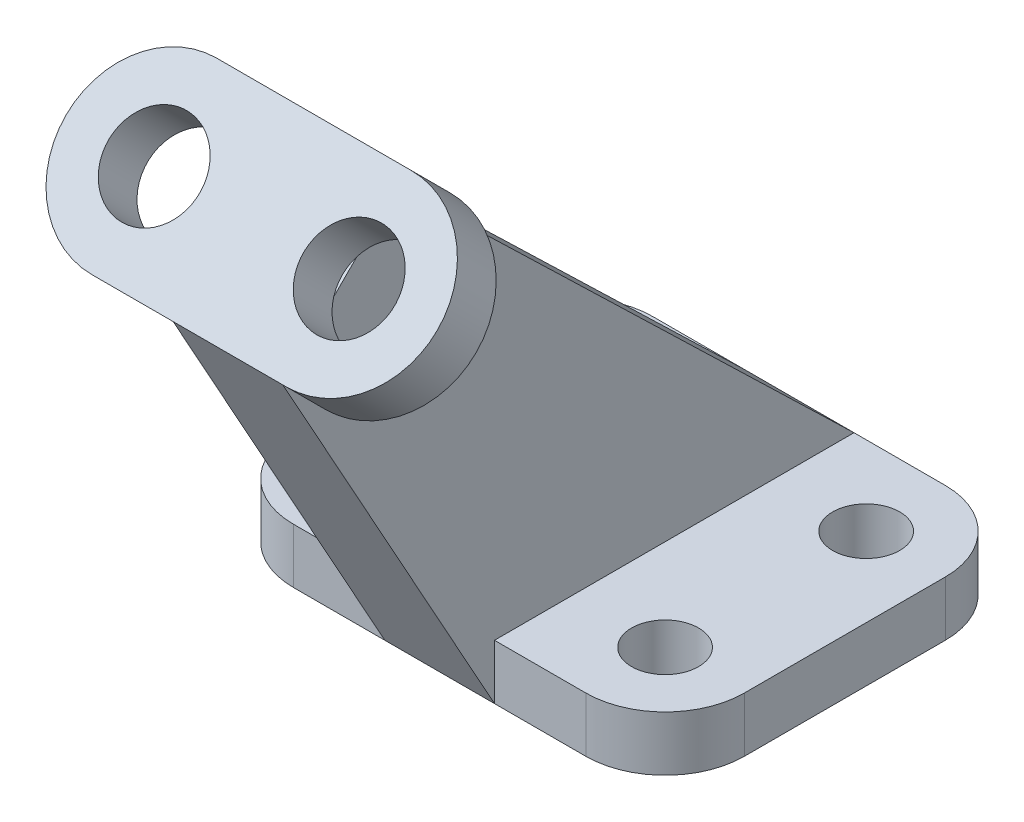
ISO-10303-21;
HEADER;
FILE_DESCRIPTION(('STEP AP214'),'2;1');
FILE_NAME('part.step','',(''),(''),'','','');
FILE_SCHEMA(('AUTOMOTIVE_DESIGN { 1 0 10303 214 1 1 1 1 }'));
ENDSEC;
DATA;
#1=APPLICATION_CONTEXT('core data for automotive mechanical design processes');
#2=APPLICATION_PROTOCOL_DEFINITION('international standard','automotive_design',2000,#1);
#3=PRODUCT_CONTEXT('',#1,'mechanical');
#4=PRODUCT('Part','Part','',(#3));
#5=PRODUCT_RELATED_PRODUCT_CATEGORY('part','',(#4));
#6=PRODUCT_DEFINITION_FORMATION('','',#4);
#7=PRODUCT_DEFINITION_CONTEXT('part definition',#1,'design');
#8=PRODUCT_DEFINITION('design','',#6,#7);
#9=PRODUCT_DEFINITION_SHAPE('','',#8);
#10=(LENGTH_UNIT() NAMED_UNIT(*) SI_UNIT(.MILLI.,.METRE.));
#11=(NAMED_UNIT(*) PLANE_ANGLE_UNIT() SI_UNIT($,.RADIAN.));
#12=(NAMED_UNIT(*) SI_UNIT($,.STERADIAN.) SOLID_ANGLE_UNIT());
#13=UNCERTAINTY_MEASURE_WITH_UNIT(LENGTH_MEASURE(1.E-05),#10,'distance_accuracy_value','');
#14=(GEOMETRIC_REPRESENTATION_CONTEXT(3) GLOBAL_UNCERTAINTY_ASSIGNED_CONTEXT((#13)) GLOBAL_UNIT_ASSIGNED_CONTEXT((#10,
#11,#12)) REPRESENTATION_CONTEXT('',''));
#15=CARTESIAN_POINT('',(0.,0.,0.));
#16=DIRECTION('',(0.,0.,1.));
#17=DIRECTION('',(1.,0.,0.));
#18=AXIS2_PLACEMENT_3D('',#15,#16,#17);
#19=CARTESIAN_POINT('',(-36.6546641791045,9.,29.4042910447761));
#20=DIRECTION('',(0.,0.,-1.));
#21=DIRECTION('',(-1.,0.,0.));
#22=AXIS2_PLACEMENT_3D('',#19,#20,#21);
#23=PLANE('',#22);
#24=DIRECTION('',(1.,0.,0.));
#25=VECTOR('',#24,1.);
#26=CARTESIAN_POINT('',(-36.6546641791045,9.,29.4042910447761));
#27=LINE('',#26,#25);
#28=CARTESIAN_POINT('',(-23.6546641791045,9.,29.4042910447761));
#29=VERTEX_POINT('',#28);
#30=CARTESIAN_POINT('',(-8.65,9.,29.4042910447761));
#31=VERTEX_POINT('',#30);
#32=EDGE_CURVE('E266',#29,#31,#27,.T.);
#33=ORIENTED_EDGE('',*,*,#32,.F.);
#34=DIRECTION('',(0.,-1.,0.));
#35=VECTOR('',#34,1.);
#36=CARTESIAN_POINT('',(-23.6546641791045,9.,29.4042910447761));
#37=LINE('',#36,#35);
#38=CARTESIAN_POINT('',(-23.6546641791045,0.,29.4042910447761));
#39=VERTEX_POINT('',#38);
#40=EDGE_CURVE('E286',#29,#39,#37,.T.);
#41=ORIENTED_EDGE('',*,*,#40,.T.);
#42=DIRECTION('',(1.,0.,0.));
#43=VECTOR('',#42,1.);
#44=CARTESIAN_POINT('',(-36.6546641791045,0.,29.4042910447761));
#45=LINE('',#44,#43);
#46=CARTESIAN_POINT('',(-8.65,0.,29.4042910447761));
#47=VERTEX_POINT('',#46);
#48=EDGE_CURVE('E254',#39,#47,#45,.T.);
#49=ORIENTED_EDGE('',*,*,#48,.T.);
#50=DIRECTION('',(0.,-1.,0.));
#51=VECTOR('',#50,1.);
#52=CARTESIAN_POINT('',(-8.65,9.,29.4042910447761));
#53=LINE('',#52,#51);
#54=EDGE_CURVE('E227',#31,#47,#53,.T.);
#55=ORIENTED_EDGE('',*,*,#54,.F.);
#56=EDGE_LOOP('',(#33,#41,#49,#55));
#57=FACE_BOUND('',#56,.T.);
#58=ADVANCED_FACE('F26',(#57),#23,.F.);
#59=CARTESIAN_POINT('',(-36.6546641791045,9.,29.4042910447761));
#60=DIRECTION('',(0.,1.,0.));
#61=DIRECTION('',(0.,0.,1.));
#62=AXIS2_PLACEMENT_3D('',#59,#60,#61);
#63=PLANE('',#62);
#64=CARTESIAN_POINT('',(-23.6546641791045,9.,16.4042910447761));
#65=DIRECTION('',(0.,1.,0.));
#66=DIRECTION('',(0.,0.,1.));
#67=AXIS2_PLACEMENT_3D('',#64,#65,#66);
#68=CIRCLE('',#67,5.5);
#69=CARTESIAN_POINT('',(-23.6546641791045,9.,21.9042910447761));
#70=VERTEX_POINT('',#69);
#71=EDGE_CURVE('E277',#70,#70,#68,.T.);
#72=ORIENTED_EDGE('',*,*,#71,.F.);
#73=EDGE_LOOP('',(#72));
#74=FACE_BOUND('',#73,.T.);
#75=CARTESIAN_POINT('',(-23.6546641791045,9.,-16.5957089552239));
#76=DIRECTION('',(0.,1.,0.));
#77=DIRECTION('',(0.,0.,1.));
#78=AXIS2_PLACEMENT_3D('',#75,#76,#77);
#79=CIRCLE('',#78,5.5);
#80=CARTESIAN_POINT('',(-23.6546641791045,9.,-11.0957089552239));
#81=VERTEX_POINT('',#80);
#82=EDGE_CURVE('E244',#81,#81,#79,.T.);
#83=ORIENTED_EDGE('',*,*,#82,.F.);
#84=EDGE_LOOP('',(#83));
#85=FACE_BOUND('',#84,.T.);
#86=DIRECTION('',(0.,0.,1.));
#87=VECTOR('',#86,1.);
#88=CARTESIAN_POINT('',(-36.6546641791045,9.,-29.5957089552239));
#89=LINE('',#88,#87);
#90=CARTESIAN_POINT('',(-36.6546641791045,9.,-16.5957089552239));
#91=VERTEX_POINT('',#90);
#92=CARTESIAN_POINT('',(-36.6546641791045,9.,16.4042910447761));
#93=VERTEX_POINT('',#92);
#94=EDGE_CURVE('E262',#91,#93,#89,.T.);
#95=ORIENTED_EDGE('',*,*,#94,.T.);
#96=CARTESIAN_POINT('',(-23.6546641791045,9.,16.4042910447761));
#97=DIRECTION('',(0.,1.,0.));
#98=DIRECTION('',(0.,0.,1.));
#99=AXIS2_PLACEMENT_3D('',#96,#97,#98);
#100=CIRCLE('',#99,13.);
#101=EDGE_CURVE('E356',#93,#29,#100,.T.);
#102=ORIENTED_EDGE('',*,*,#101,.T.);
#103=ORIENTED_EDGE('',*,*,#32,.T.);
#104=DIRECTION('',(0.,0.,-1.));
#105=VECTOR('',#104,1.);
#106=CARTESIAN_POINT('',(-8.65,9.,29.4042910447761));
#107=LINE('',#106,#105);
#108=CARTESIAN_POINT('',(-8.65,9.,-29.5957089552239));
#109=VERTEX_POINT('',#108);
#110=EDGE_CURVE('E230',#31,#109,#107,.T.);
#111=ORIENTED_EDGE('',*,*,#110,.T.);
#112=DIRECTION('',(-1.,0.,0.));
#113=VECTOR('',#112,1.);
#114=CARTESIAN_POINT('',(-36.6546641791045,9.,-29.5957089552239));
#115=LINE('',#114,#113);
#116=CARTESIAN_POINT('',(-23.6546641791045,9.,-29.5957089552239));
#117=VERTEX_POINT('',#116);
#118=EDGE_CURVE('E270',#109,#117,#115,.T.);
#119=ORIENTED_EDGE('',*,*,#118,.T.);
#120=CARTESIAN_POINT('',(-23.6546641791045,9.,-16.5957089552239));
#121=DIRECTION('',(0.,1.,0.));
#122=DIRECTION('',(0.,0.,1.));
#123=AXIS2_PLACEMENT_3D('',#120,#121,#122);
#124=CIRCLE('',#123,13.);
#125=EDGE_CURVE('E347',#117,#91,#124,.T.);
#126=ORIENTED_EDGE('',*,*,#125,.T.);
#127=EDGE_LOOP('',(#95,#102,#103,#111,#119,#126));
#128=FACE_BOUND('',#127,.T.);
#129=ADVANCED_FACE('F346',(#74,#85,#128),#63,.T.);
#130=CARTESIAN_POINT('',(-36.6546641791045,9.,-29.5957089552239));
#131=DIRECTION('',(1.,0.,0.));
#132=DIRECTION('',(0.,0.,-1.));
#133=AXIS2_PLACEMENT_3D('',#130,#131,#132);
#134=PLANE('',#133);
#135=DIRECTION('',(0.,0.,1.));
#136=VECTOR('',#135,1.);
#137=CARTESIAN_POINT('',(-36.6546641791045,0.,-29.5957089552239));
#138=LINE('',#137,#136);
#139=CARTESIAN_POINT('',(-36.6546641791045,0.,-16.5957089552239));
#140=VERTEX_POINT('',#139);
#141=CARTESIAN_POINT('',(-36.6546641791045,0.,16.4042910447761));
#142=VERTEX_POINT('',#141);
#143=EDGE_CURVE('E250',#140,#142,#138,.T.);
#144=ORIENTED_EDGE('',*,*,#143,.T.);
#145=DIRECTION('',(0.,-1.,0.));
#146=VECTOR('',#145,1.);
#147=CARTESIAN_POINT('',(-36.6546641791045,9.,16.4042910447761));
#148=LINE('',#147,#146);
#149=EDGE_CURVE('E357',#142,#93,#148,.F.);
#150=ORIENTED_EDGE('',*,*,#149,.T.);
#151=ORIENTED_EDGE('',*,*,#94,.F.);
#152=DIRECTION('',(0.,-1.,0.));
#153=VECTOR('',#152,1.);
#154=CARTESIAN_POINT('',(-36.6546641791045,9.,-16.5957089552239));
#155=LINE('',#154,#153);
#156=EDGE_CURVE('E355',#91,#140,#155,.T.);
#157=ORIENTED_EDGE('',*,*,#156,.T.);
#158=EDGE_LOOP('',(#144,#150,#151,#157));
#159=FACE_BOUND('',#158,.T.);
#160=ADVANCED_FACE('F393',(#159),#134,.F.);
#161=CARTESIAN_POINT('',(9.35,0.,29.4042910447761));
#162=VERTEX_POINT('',#161);
#163=CARTESIAN_POINT('',(24.3453358208955,0.,29.4042910447761));
#164=VERTEX_POINT('',#163);
#165=EDGE_CURVE('E253',#162,#164,#45,.T.);
#166=ORIENTED_EDGE('',*,*,#165,.T.);
#167=DIRECTION('',(0.,-1.,0.));
#168=VECTOR('',#167,1.);
#169=CARTESIAN_POINT('',(24.3453358208955,9.,29.4042910447761));
#170=LINE('',#169,#168);
#171=CARTESIAN_POINT('',(24.3453358208955,9.,29.4042910447761));
#172=VERTEX_POINT('',#171);
#173=EDGE_CURVE('E11',#164,#172,#170,.F.);
#174=ORIENTED_EDGE('',*,*,#173,.T.);
#175=CARTESIAN_POINT('',(9.35,9.,29.4042910447761));
#176=VERTEX_POINT('',#175);
#177=EDGE_CURVE('E265',#176,#172,#27,.T.);
#178=ORIENTED_EDGE('',*,*,#177,.F.);
#179=DIRECTION('',(0.,-1.,0.));
#180=VECTOR('',#179,1.);
#181=CARTESIAN_POINT('',(9.35,9.,29.4042910447761));
#182=LINE('',#181,#180);
#183=EDGE_CURVE('E232',#176,#162,#182,.T.);
#184=ORIENTED_EDGE('',*,*,#183,.T.);
#185=EDGE_LOOP('',(#166,#174,#178,#184));
#186=FACE_BOUND('',#185,.T.);
#187=ADVANCED_FACE('F407',(#186),#23,.F.);
#188=CARTESIAN_POINT('',(37.3453358208955,9.,-29.5957089552239));
#189=DIRECTION('',(-1.,0.,0.));
#190=DIRECTION('',(0.,0.,1.));
#191=AXIS2_PLACEMENT_3D('',#188,#189,#190);
#192=PLANE('',#191);
#193=DIRECTION('',(0.,0.,-1.));
#194=VECTOR('',#193,1.);
#195=CARTESIAN_POINT('',(37.3453358208955,0.,-29.5957089552239));
#196=LINE('',#195,#194);
#197=CARTESIAN_POINT('',(37.3453358208955,0.,16.4042910447761));
#198=VERTEX_POINT('',#197);
#199=CARTESIAN_POINT('',(37.3453358208955,0.,-16.5957089552239));
#200=VERTEX_POINT('',#199);
#201=EDGE_CURVE('E256',#198,#200,#196,.T.);
#202=ORIENTED_EDGE('',*,*,#201,.T.);
#203=DIRECTION('',(0.,-1.,0.));
#204=VECTOR('',#203,1.);
#205=CARTESIAN_POINT('',(37.3453358208955,9.,-16.5957089552239));
#206=LINE('',#205,#204);
#207=CARTESIAN_POINT('',(37.3453358208955,9.,-16.5957089552239));
#208=VERTEX_POINT('',#207);
#209=EDGE_CURVE('E47',#200,#208,#206,.F.);
#210=ORIENTED_EDGE('',*,*,#209,.T.);
#211=DIRECTION('',(0.,0.,-1.));
#212=VECTOR('',#211,1.);
#213=CARTESIAN_POINT('',(37.3453358208955,9.,-29.5957089552239));
#214=LINE('',#213,#212);
#215=CARTESIAN_POINT('',(37.3453358208955,9.,16.4042910447761));
#216=VERTEX_POINT('',#215);
#217=EDGE_CURVE('E268',#216,#208,#214,.T.);
#218=ORIENTED_EDGE('',*,*,#217,.F.);
#219=DIRECTION('',(0.,-1.,0.));
#220=VECTOR('',#219,1.);
#221=CARTESIAN_POINT('',(37.3453358208955,9.,16.4042910447761));
#222=LINE('',#221,#220);
#223=EDGE_CURVE('E367',#216,#198,#222,.T.);
#224=ORIENTED_EDGE('',*,*,#223,.T.);
#225=EDGE_LOOP('',(#202,#210,#218,#224));
#226=FACE_BOUND('',#225,.T.);
#227=ADVANCED_FACE('F413',(#226),#192,.F.);
#228=CARTESIAN_POINT('',(-36.6546641791045,9.,-29.5957089552239));
#229=DIRECTION('',(0.,0.,1.));
#230=DIRECTION('',(1.,0.,0.));
#231=AXIS2_PLACEMENT_3D('',#228,#229,#230);
#232=PLANE('',#231);
#233=DIRECTION('',(-1.,0.,0.));
#234=VECTOR('',#233,1.);
#235=CARTESIAN_POINT('',(-36.6546641791045,0.,-29.5957089552239));
#236=LINE('',#235,#234);
#237=CARTESIAN_POINT('',(24.3453358208955,0.,-29.5957089552239));
#238=VERTEX_POINT('',#237);
#239=CARTESIAN_POINT('',(-23.6546641791045,0.,-29.5957089552239));
#240=VERTEX_POINT('',#239);
#241=EDGE_CURVE('E259',#238,#240,#236,.T.);
#242=ORIENTED_EDGE('',*,*,#241,.T.);
#243=DIRECTION('',(0.,-1.,0.));
#244=VECTOR('',#243,1.);
#245=CARTESIAN_POINT('',(-23.6546641791045,9.,-29.5957089552239));
#246=LINE('',#245,#244);
#247=EDGE_CURVE('E353',#240,#117,#246,.F.);
#248=ORIENTED_EDGE('',*,*,#247,.T.);
#249=ORIENTED_EDGE('',*,*,#118,.F.);
#250=CARTESIAN_POINT('',(9.35,9.,-29.5957089552239));
#251=VERTEX_POINT('',#250);
#252=EDGE_CURVE('E274',#251,#109,#115,.T.);
#253=ORIENTED_EDGE('',*,*,#252,.F.);
#254=CARTESIAN_POINT('',(24.3453358208955,9.,-29.5957089552239));
#255=VERTEX_POINT('',#254);
#256=EDGE_CURVE('E271',#255,#251,#115,.T.);
#257=ORIENTED_EDGE('',*,*,#256,.F.);
#258=DIRECTION('',(0.,-1.,0.));
#259=VECTOR('',#258,1.);
#260=CARTESIAN_POINT('',(24.3453358208955,9.,-29.5957089552239));
#261=LINE('',#260,#259);
#262=EDGE_CURVE('E359',#255,#238,#261,.T.);
#263=ORIENTED_EDGE('',*,*,#262,.T.);
#264=EDGE_LOOP('',(#242,#248,#249,#253,#257,#263));
#265=FACE_BOUND('',#264,.T.);
#266=ADVANCED_FACE('F378',(#265),#232,.F.);
#267=ORIENTED_EDGE('',*,*,#217,.T.);
#268=CARTESIAN_POINT('',(24.3453358208955,9.,-16.5957089552239));
#269=DIRECTION('',(0.,1.,0.));
#270=DIRECTION('',(0.,0.,1.));
#271=AXIS2_PLACEMENT_3D('',#268,#269,#270);
#272=CIRCLE('',#271,13.);
#273=EDGE_CURVE('E34',#208,#255,#272,.T.);
#274=ORIENTED_EDGE('',*,*,#273,.T.);
#275=ORIENTED_EDGE('',*,*,#256,.T.);
#276=DIRECTION('',(0.,0.,-1.));
#277=VECTOR('',#276,1.);
#278=CARTESIAN_POINT('',(9.35,9.,29.4042910447761));
#279=LINE('',#278,#277);
#280=EDGE_CURVE('E235',#176,#251,#279,.T.);
#281=ORIENTED_EDGE('',*,*,#280,.F.);
#282=ORIENTED_EDGE('',*,*,#177,.T.);
#283=CARTESIAN_POINT('',(24.3453358208955,9.,16.4042910447761));
#284=DIRECTION('',(0.,1.,0.));
#285=DIRECTION('',(0.,0.,1.));
#286=AXIS2_PLACEMENT_3D('',#283,#284,#285);
#287=CIRCLE('',#286,13.);
#288=EDGE_CURVE('E371',#172,#216,#287,.T.);
#289=ORIENTED_EDGE('',*,*,#288,.T.);
#290=EDGE_LOOP('',(#267,#274,#275,#281,#282,#289));
#291=FACE_BOUND('',#290,.T.);
#292=CARTESIAN_POINT('',(24.3453358208955,9.,-16.5957089552239));
#293=DIRECTION('',(0.,1.,0.));
#294=DIRECTION('',(0.,0.,1.));
#295=AXIS2_PLACEMENT_3D('',#292,#293,#294);
#296=CIRCLE('',#295,5.5);
#297=CARTESIAN_POINT('',(24.3453358208955,9.,-11.0957089552239));
#298=VERTEX_POINT('',#297);
#299=EDGE_CURVE('E241',#298,#298,#296,.T.);
#300=ORIENTED_EDGE('',*,*,#299,.F.);
#301=EDGE_LOOP('',(#300));
#302=FACE_BOUND('',#301,.T.);
#303=CARTESIAN_POINT('',(24.3453358208955,9.,16.4042910447761));
#304=DIRECTION('',(0.,1.,0.));
#305=DIRECTION('',(0.,0.,1.));
#306=AXIS2_PLACEMENT_3D('',#303,#304,#305);
#307=CIRCLE('',#306,5.5);
#308=CARTESIAN_POINT('',(24.3453358208955,9.,21.9042910447761));
#309=VERTEX_POINT('',#308);
#310=EDGE_CURVE('E283',#309,#309,#307,.T.);
#311=ORIENTED_EDGE('',*,*,#310,.F.);
#312=EDGE_LOOP('',(#311));
#313=FACE_BOUND('',#312,.T.);
#314=ADVANCED_FACE('F374',(#291,#302,#313),#63,.T.);
#315=CARTESIAN_POINT('',(-36.6546641791045,0.,29.4042910447761));
#316=DIRECTION('',(0.,1.,0.));
#317=DIRECTION('',(0.,0.,1.));
#318=AXIS2_PLACEMENT_3D('',#315,#316,#317);
#319=PLANE('',#318);
#320=CARTESIAN_POINT('',(24.3453358208955,0.,-16.5957089552239));
#321=DIRECTION('',(0.,1.,0.));
#322=DIRECTION('',(0.,0.,1.));
#323=AXIS2_PLACEMENT_3D('',#320,#321,#322);
#324=CIRCLE('',#323,5.5);
#325=CARTESIAN_POINT('',(24.3453358208955,0.,-11.0957089552239));
#326=VERTEX_POINT('',#325);
#327=EDGE_CURVE('E238',#326,#326,#324,.T.);
#328=ORIENTED_EDGE('',*,*,#327,.T.);
#329=EDGE_LOOP('',(#328));
#330=FACE_BOUND('',#329,.T.);
#331=ORIENTED_EDGE('',*,*,#48,.F.);
#332=CARTESIAN_POINT('',(-23.6546641791045,0.,16.4042910447761));
#333=DIRECTION('',(0.,1.,0.));
#334=DIRECTION('',(0.,0.,1.));
#335=AXIS2_PLACEMENT_3D('',#332,#333,#334);
#336=CIRCLE('',#335,13.);
#337=EDGE_CURVE('E387',#39,#142,#336,.F.);
#338=ORIENTED_EDGE('',*,*,#337,.T.);
#339=ORIENTED_EDGE('',*,*,#143,.F.);
#340=CARTESIAN_POINT('',(-23.6546641791045,0.,-16.5957089552239));
#341=DIRECTION('',(0.,1.,0.));
#342=DIRECTION('',(0.,0.,1.));
#343=AXIS2_PLACEMENT_3D('',#340,#341,#342);
#344=CIRCLE('',#343,13.);
#345=EDGE_CURVE('E384',#140,#240,#344,.F.);
#346=ORIENTED_EDGE('',*,*,#345,.T.);
#347=ORIENTED_EDGE('',*,*,#241,.F.);
#348=CARTESIAN_POINT('',(24.3453358208955,0.,-16.5957089552239));
#349=DIRECTION('',(0.,1.,0.));
#350=DIRECTION('',(0.,0.,1.));
#351=AXIS2_PLACEMENT_3D('',#348,#349,#350);
#352=CIRCLE('',#351,13.);
#353=EDGE_CURVE('E381',#238,#200,#352,.F.);
#354=ORIENTED_EDGE('',*,*,#353,.T.);
#355=ORIENTED_EDGE('',*,*,#201,.F.);
#356=CARTESIAN_POINT('',(24.3453358208955,0.,16.4042910447761));
#357=DIRECTION('',(0.,1.,0.));
#358=DIRECTION('',(0.,0.,1.));
#359=AXIS2_PLACEMENT_3D('',#356,#357,#358);
#360=CIRCLE('',#359,13.);
#361=EDGE_CURVE('E385',#198,#164,#360,.F.);
#362=ORIENTED_EDGE('',*,*,#361,.T.);
#363=ORIENTED_EDGE('',*,*,#165,.F.);
#364=EDGE_CURVE('E257',#47,#162,#45,.T.);
#365=ORIENTED_EDGE('',*,*,#364,.F.);
#366=EDGE_LOOP('',(#331,#338,#339,#346,#347,#354,#355,#362,#363,#365));
#367=FACE_BOUND('',#366,.T.);
#368=CARTESIAN_POINT('',(24.3453358208955,0.,16.4042910447761));
#369=DIRECTION('',(0.,1.,0.));
#370=DIRECTION('',(0.,0.,1.));
#371=AXIS2_PLACEMENT_3D('',#368,#369,#370);
#372=CIRCLE('',#371,5.5);
#373=CARTESIAN_POINT('',(24.3453358208955,0.,21.9042910447761));
#374=VERTEX_POINT('',#373);
#375=EDGE_CURVE('E280',#374,#374,#372,.T.);
#376=ORIENTED_EDGE('',*,*,#375,.T.);
#377=EDGE_LOOP('',(#376));
#378=FACE_BOUND('',#377,.T.);
#379=CARTESIAN_POINT('',(-23.6546641791045,0.,16.4042910447761));
#380=DIRECTION('',(0.,1.,0.));
#381=DIRECTION('',(0.,0.,1.));
#382=AXIS2_PLACEMENT_3D('',#379,#380,#381);
#383=CIRCLE('',#382,5.5);
#384=CARTESIAN_POINT('',(-23.6546641791045,0.,21.9042910447761));
#385=VERTEX_POINT('',#384);
#386=EDGE_CURVE('E273',#385,#385,#383,.T.);
#387=ORIENTED_EDGE('',*,*,#386,.T.);
#388=EDGE_LOOP('',(#387));
#389=FACE_BOUND('',#388,.T.);
#390=CARTESIAN_POINT('',(-23.6546641791045,0.,-16.5957089552239));
#391=DIRECTION('',(0.,1.,0.));
#392=DIRECTION('',(0.,0.,1.));
#393=AXIS2_PLACEMENT_3D('',#390,#391,#392);
#394=CIRCLE('',#393,5.5);
#395=CARTESIAN_POINT('',(-23.6546641791045,0.,-11.0957089552239));
#396=VERTEX_POINT('',#395);
#397=EDGE_CURVE('E247',#396,#396,#394,.T.);
#398=ORIENTED_EDGE('',*,*,#397,.T.);
#399=EDGE_LOOP('',(#398));
#400=FACE_BOUND('',#399,.T.);
#401=ADVANCED_FACE('F396',(#330,#367,#378,#389,#400),#319,.F.);
#402=CARTESIAN_POINT('',(-23.6546641791045,0.,-16.5957089552239));
#403=DIRECTION('',(0.,1.,0.));
#404=DIRECTION('',(0.,0.,1.));
#405=AXIS2_PLACEMENT_3D('',#402,#403,#404);
#406=CYLINDRICAL_SURFACE('',#405,5.5);
#407=ORIENTED_EDGE('',*,*,#397,.F.);
#408=EDGE_LOOP('',(#407));
#409=FACE_BOUND('',#408,.T.);
#410=ORIENTED_EDGE('',*,*,#82,.T.);
#411=EDGE_LOOP('',(#410));
#412=FACE_BOUND('',#411,.T.);
#413=ADVANCED_FACE('F440',(#409,#412),#406,.F.);
#414=CARTESIAN_POINT('',(24.3453358208955,0.,-16.5957089552239));
#415=DIRECTION('',(0.,1.,0.));
#416=DIRECTION('',(0.,0.,1.));
#417=AXIS2_PLACEMENT_3D('',#414,#415,#416);
#418=CYLINDRICAL_SURFACE('',#417,5.5);
#419=ORIENTED_EDGE('',*,*,#327,.F.);
#420=EDGE_LOOP('',(#419));
#421=FACE_BOUND('',#420,.T.);
#422=ORIENTED_EDGE('',*,*,#299,.T.);
#423=EDGE_LOOP('',(#422));
#424=FACE_BOUND('',#423,.T.);
#425=ADVANCED_FACE('F433',(#421,#424),#418,.F.);
#426=CARTESIAN_POINT('',(-23.6546641791045,0.,16.4042910447761));
#427=DIRECTION('',(0.,1.,0.));
#428=DIRECTION('',(0.,0.,1.));
#429=AXIS2_PLACEMENT_3D('',#426,#427,#428);
#430=CYLINDRICAL_SURFACE('',#429,5.5);
#431=ORIENTED_EDGE('',*,*,#386,.F.);
#432=EDGE_LOOP('',(#431));
#433=FACE_BOUND('',#432,.T.);
#434=ORIENTED_EDGE('',*,*,#71,.T.);
#435=EDGE_LOOP('',(#434));
#436=FACE_BOUND('',#435,.T.);
#437=ADVANCED_FACE('F431',(#433,#436),#430,.F.);
#438=CARTESIAN_POINT('',(24.3453358208955,0.,16.4042910447761));
#439=DIRECTION('',(0.,1.,0.));
#440=DIRECTION('',(0.,0.,1.));
#441=AXIS2_PLACEMENT_3D('',#438,#439,#440);
#442=CYLINDRICAL_SURFACE('',#441,5.5);
#443=ORIENTED_EDGE('',*,*,#375,.F.);
#444=EDGE_LOOP('',(#443));
#445=FACE_BOUND('',#444,.T.);
#446=ORIENTED_EDGE('',*,*,#310,.T.);
#447=EDGE_LOOP('',(#446));
#448=FACE_BOUND('',#447,.T.);
#449=ADVANCED_FACE('F28',(#445,#448),#442,.F.);
#450=CARTESIAN_POINT('',(0.35,81.4124614893249,45.389590013165));
#451=DIRECTION('',(0.,-0.719339800338655,0.694658370458994));
#452=DIRECTION('',(0.,-0.694658370458994,-0.719339800338655));
#453=AXIS2_PLACEMENT_3D('',#450,#451,#452);
#454=PLANE('',#453);
#455=DIRECTION('',(0.,-0.694658370458994,-0.719339800338655));
#456=VECTOR('',#455,1.);
#457=CARTESIAN_POINT('',(9.35,81.4124614893249,45.389590013165));
#458=LINE('',#457,#456);
#459=CARTESIAN_POINT('',(9.35,81.4124614893249,45.389590013165));
#460=VERTEX_POINT('',#459);
#461=EDGE_CURVE('E217',#460,#251,#458,.T.);
#462=ORIENTED_EDGE('',*,*,#461,.T.);
#463=ORIENTED_EDGE('',*,*,#252,.T.);
#464=DIRECTION('',(0.,-0.694658370458994,-0.719339800338655));
#465=VECTOR('',#464,1.);
#466=CARTESIAN_POINT('',(-8.65,81.4124614893249,45.389590013165));
#467=LINE('',#466,#465);
#468=CARTESIAN_POINT('',(-8.65,81.4124614893249,45.389590013165));
#469=VERTEX_POINT('',#468);
#470=EDGE_CURVE('E183',#469,#109,#467,.T.);
#471=ORIENTED_EDGE('',*,*,#470,.F.);
#472=DIRECTION('',(1.,0.,0.));
#473=VECTOR('',#472,1.);
#474=CARTESIAN_POINT('',(0.35,81.4124614893249,45.389590013165));
#475=LINE('',#474,#473);
#476=EDGE_CURVE('E179',#469,#460,#475,.T.);
#477=ORIENTED_EDGE('',*,*,#476,.T.);
#478=EDGE_LOOP('',(#462,#463,#471,#477));
#479=FACE_BOUND('',#478,.T.);
#480=ADVANCED_FACE('F338',(#479),#454,.F.);
#481=CARTESIAN_POINT('',(0.35,0.,29.4042910447761));
#482=DIRECTION('',(0.,0.484809620246335,-0.874619707139397));
#483=DIRECTION('',(0.,0.874619707139397,0.484809620246335));
#484=AXIS2_PLACEMENT_3D('',#481,#482,#483);
#485=PLANE('',#484);
#486=DIRECTION('',(0.,0.874619707139397,0.484809620246335));
#487=VECTOR('',#486,1.);
#488=CARTESIAN_POINT('',(-8.65,0.,29.4042910447761));
#489=LINE('',#488,#487);
#490=CARTESIAN_POINT('',(-8.65,62.6630594261024,64.1389920763872));
#491=VERTEX_POINT('',#490);
#492=EDGE_CURVE('E189',#47,#491,#489,.T.);
#493=ORIENTED_EDGE('',*,*,#492,.F.);
#494=ORIENTED_EDGE('',*,*,#364,.T.);
#495=DIRECTION('',(0.,0.874619707139397,0.484809620246335));
#496=VECTOR('',#495,1.);
#497=CARTESIAN_POINT('',(9.35,0.,29.4042910447761));
#498=LINE('',#497,#496);
#499=CARTESIAN_POINT('',(9.35,62.6630594261024,64.1389920763872));
#500=VERTEX_POINT('',#499);
#501=EDGE_CURVE('E287',#162,#500,#498,.T.);
#502=ORIENTED_EDGE('',*,*,#501,.T.);
#503=DIRECTION('',(1.,0.,0.));
#504=VECTOR('',#503,1.);
#505=CARTESIAN_POINT('',(0.35,62.6630594261024,64.1389920763872));
#506=LINE('',#505,#504);
#507=EDGE_CURVE('E228',#491,#500,#506,.T.);
#508=ORIENTED_EDGE('',*,*,#507,.F.);
#509=EDGE_LOOP('',(#493,#494,#502,#508));
#510=FACE_BOUND('',#509,.T.);
#511=ADVANCED_FACE('F303',(#510),#485,.F.);
#512=CARTESIAN_POINT('',(9.35,29.1592433133023,11.7327999303576));
#513=DIRECTION('',(1.,0.,0.));
#514=DIRECTION('',(0.,0.,-1.));
#515=AXIS2_PLACEMENT_3D('',#512,#513,#514);
#516=PLANE('',#515);
#517=ORIENTED_EDGE('',*,*,#183,.F.);
#518=ORIENTED_EDGE('',*,*,#280,.T.);
#519=ORIENTED_EDGE('',*,*,#461,.F.);
#520=DIRECTION('',(0.,0.707106781186551,-0.707106781186544));
#521=VECTOR('',#520,1.);
#522=CARTESIAN_POINT('',(9.35,62.6630594261024,64.1389920763872));
#523=LINE('',#522,#521);
#524=CARTESIAN_POINT('',(9.35,74.8200510297734,51.9820004727164));
#525=VERTEX_POINT('',#524);
#526=EDGE_CURVE('E193',#525,#460,#523,.T.);
#527=ORIENTED_EDGE('',*,*,#526,.F.);
#528=CARTESIAN_POINT('',(9.35,71.0121644768415,55.7898870256483));
#529=VERTEX_POINT('',#528);
#530=EDGE_CURVE('E209',#529,#525,#523,.T.);
#531=ORIENTED_EDGE('',*,*,#530,.F.);
#532=EDGE_CURVE('E211',#500,#529,#523,.T.);
#533=ORIENTED_EDGE('',*,*,#532,.F.);
#534=ORIENTED_EDGE('',*,*,#501,.F.);
#535=EDGE_LOOP('',(#517,#518,#519,#527,#531,#533,#534));
#536=FACE_BOUND('',#535,.T.);
#537=ADVANCED_FACE('F527',(#536),#516,.T.);
#538=CARTESIAN_POINT('',(-8.65,29.1592433133023,11.7327999303576));
#539=DIRECTION('',(1.,0.,0.));
#540=DIRECTION('',(0.,0.,-1.));
#541=AXIS2_PLACEMENT_3D('',#538,#539,#540);
#542=PLANE('',#541);
#543=ORIENTED_EDGE('',*,*,#110,.F.);
#544=ORIENTED_EDGE('',*,*,#54,.T.);
#545=ORIENTED_EDGE('',*,*,#492,.T.);
#546=DIRECTION('',(0.,0.707106781186551,-0.707106781186544));
#547=VECTOR('',#546,1.);
#548=CARTESIAN_POINT('',(-8.65,62.6630594261024,64.1389920763872));
#549=LINE('',#548,#547);
#550=CARTESIAN_POINT('',(-8.65,71.0121644768414,55.7898870256483));
#551=VERTEX_POINT('',#550);
#552=EDGE_CURVE('E187',#491,#551,#549,.T.);
#553=ORIENTED_EDGE('',*,*,#552,.T.);
#554=CARTESIAN_POINT('',(-8.65,74.8200510297734,51.9820004727164));
#555=VERTEX_POINT('',#554);
#556=EDGE_CURVE('E173',#551,#555,#549,.T.);
#557=ORIENTED_EDGE('',*,*,#556,.T.);
#558=EDGE_CURVE('E176',#555,#469,#549,.T.);
#559=ORIENTED_EDGE('',*,*,#558,.T.);
#560=ORIENTED_EDGE('',*,*,#470,.T.);
#561=EDGE_LOOP('',(#543,#544,#545,#553,#557,#559,#560));
#562=FACE_BOUND('',#561,.T.);
#563=ADVANCED_FACE('F186',(#562),#542,.F.);
#564=CARTESIAN_POINT('',(16.35,72.9161077533074,53.8859437491824));
#565=DIRECTION('',(0.,-0.707106781186544,-0.707106781186551));
#566=DIRECTION('',(0.,0.707106781186551,-0.707106781186544));
#567=AXIS2_PLACEMENT_3D('',#564,#565,#566);
#568=PLANE('',#567);
#569=CARTESIAN_POINT('',(-15.65,72.9161077533074,53.8859437491824));
#570=DIRECTION('',(0.,0.707106781186544,0.707106781186551));
#571=DIRECTION('',(0.,-0.707106781186551,0.707106781186544));
#572=AXIS2_PLACEMENT_3D('',#569,#570,#571);
#573=CIRCLE('',#572,7.5);
#574=EDGE_CURVE('E158',#555,#551,#573,.T.);
#575=ORIENTED_EDGE('',*,*,#574,.T.);
#576=ORIENTED_EDGE('',*,*,#552,.F.);
#577=DIRECTION('',(1.,0.,0.));
#578=VECTOR('',#577,1.);
#579=CARTESIAN_POINT('',(16.35,62.6630594261024,64.1389920763873));
#580=LINE('',#579,#578);
#581=CARTESIAN_POINT('',(-15.65,62.6630594261024,64.1389920763873));
#582=VERTEX_POINT('',#581);
#583=EDGE_CURVE('E301',#582,#491,#580,.T.);
#584=ORIENTED_EDGE('',*,*,#583,.F.);
#585=CARTESIAN_POINT('',(-15.65,72.9161077533074,53.8859437491824));
#586=DIRECTION('',(0.,0.707106781186544,0.707106781186551));
#587=DIRECTION('',(0.,0.707106781186551,-0.707106781186544));
#588=AXIS2_PLACEMENT_3D('',#585,#586,#587);
#589=CIRCLE('',#588,14.5);
#590=CARTESIAN_POINT('',(-15.65,83.1691560805124,43.6328954219775));
#591=VERTEX_POINT('',#590);
#592=EDGE_CURVE('E308',#591,#582,#589,.T.);
#593=ORIENTED_EDGE('',*,*,#592,.F.);
#594=DIRECTION('',(-1.,0.,0.));
#595=VECTOR('',#594,1.);
#596=CARTESIAN_POINT('',(16.35,83.1691560805124,43.6328954219775));
#597=LINE('',#596,#595);
#598=CARTESIAN_POINT('',(16.35,83.1691560805124,43.6328954219775));
#599=VERTEX_POINT('',#598);
#600=EDGE_CURVE('E624',#599,#591,#597,.T.);
#601=ORIENTED_EDGE('',*,*,#600,.F.);
#602=CARTESIAN_POINT('',(16.35,72.9161077533074,53.8859437491824));
#603=DIRECTION('',(0.,0.707106781186544,0.707106781186551));
#604=DIRECTION('',(0.,0.707106781186551,-0.707106781186544));
#605=AXIS2_PLACEMENT_3D('',#602,#603,#604);
#606=CIRCLE('',#605,14.5);
#607=CARTESIAN_POINT('',(16.35,62.6630594261024,64.1389920763873));
#608=VERTEX_POINT('',#607);
#609=EDGE_CURVE('E623',#608,#599,#606,.T.);
#610=ORIENTED_EDGE('',*,*,#609,.F.);
#611=EDGE_CURVE('E200',#500,#608,#580,.T.);
#612=ORIENTED_EDGE('',*,*,#611,.F.);
#613=ORIENTED_EDGE('',*,*,#532,.T.);
#614=CARTESIAN_POINT('',(16.35,72.9161077533074,53.8859437491824));
#615=DIRECTION('',(0.,0.707106781186544,0.707106781186551));
#616=DIRECTION('',(0.,-0.707106781186551,0.707106781186544));
#617=AXIS2_PLACEMENT_3D('',#614,#615,#616);
#618=CIRCLE('',#617,7.5);
#619=EDGE_CURVE('E628',#529,#525,#618,.T.);
#620=ORIENTED_EDGE('',*,*,#619,.T.);
#621=ORIENTED_EDGE('',*,*,#526,.T.);
#622=ORIENTED_EDGE('',*,*,#476,.F.);
#623=ORIENTED_EDGE('',*,*,#558,.F.);
#624=EDGE_LOOP('',(#575,#576,#584,#593,#601,#610,#612,#613,#620,#621,#622,#623));
#625=FACE_BOUND('',#624,.T.);
#626=ADVANCED_FACE('F177',(#625),#568,.T.);
#627=CARTESIAN_POINT('',(16.35,79.2800687839863,60.2499047798613));
#628=DIRECTION('',(0.,-0.707106781186544,-0.707106781186551));
#629=DIRECTION('',(0.,0.707106781186551,-0.707106781186544));
#630=AXIS2_PLACEMENT_3D('',#627,#628,#629);
#631=CYLINDRICAL_SURFACE('',#630,14.5);
#632=ORIENTED_EDGE('',*,*,#609,.T.);
#633=DIRECTION('',(0.,-0.707106781186544,-0.707106781186551));
#634=VECTOR('',#633,1.);
#635=CARTESIAN_POINT('',(16.35,89.5331171111913,49.9968564526565));
#636=LINE('',#635,#634);
#637=CARTESIAN_POINT('',(16.35,89.5331171111913,49.9968564526565));
#638=VERTEX_POINT('',#637);
#639=EDGE_CURVE('E314',#638,#599,#636,.T.);
#640=ORIENTED_EDGE('',*,*,#639,.F.);
#641=CARTESIAN_POINT('',(16.35,79.2800687839863,60.2499047798613));
#642=DIRECTION('',(0.,0.707106781186544,0.707106781186551));
#643=DIRECTION('',(0.,0.707106781186551,-0.707106781186544));
#644=AXIS2_PLACEMENT_3D('',#641,#642,#643);
#645=CIRCLE('',#644,14.5);
#646=CARTESIAN_POINT('',(16.35,69.0270204567813,70.5029531070662));
#647=VERTEX_POINT('',#646);
#648=EDGE_CURVE('E309',#647,#638,#645,.T.);
#649=ORIENTED_EDGE('',*,*,#648,.F.);
#650=DIRECTION('',(0.,-0.707106781186544,-0.707106781186551));
#651=VECTOR('',#650,1.);
#652=CARTESIAN_POINT('',(16.35,69.0270204567813,70.5029531070662));
#653=LINE('',#652,#651);
#654=EDGE_CURVE('E326',#647,#608,#653,.T.);
#655=ORIENTED_EDGE('',*,*,#654,.T.);
#656=EDGE_LOOP('',(#632,#640,#649,#655));
#657=FACE_BOUND('',#656,.T.);
#658=ADVANCED_FACE('F510',(#657),#631,.T.);
#659=CARTESIAN_POINT('',(16.35,89.5331171111913,49.9968564526565));
#660=DIRECTION('',(0.,-0.707106781186551,0.707106781186544));
#661=DIRECTION('',(0.,-0.707106781186544,-0.707106781186551));
#662=AXIS2_PLACEMENT_3D('',#659,#660,#661);
#663=PLANE('',#662);
#664=ORIENTED_EDGE('',*,*,#600,.T.);
#665=DIRECTION('',(0.,-0.707106781186544,-0.707106781186551));
#666=VECTOR('',#665,1.);
#667=CARTESIAN_POINT('',(-15.65,89.5331171111913,49.9968564526565));
#668=LINE('',#667,#666);
#669=CARTESIAN_POINT('',(-15.65,89.5331171111913,49.9968564526565));
#670=VERTEX_POINT('',#669);
#671=EDGE_CURVE('E329',#670,#591,#668,.T.);
#672=ORIENTED_EDGE('',*,*,#671,.F.);
#673=DIRECTION('',(-1.,0.,0.));
#674=VECTOR('',#673,1.);
#675=CARTESIAN_POINT('',(16.35,89.5331171111913,49.9968564526565));
#676=LINE('',#675,#674);
#677=EDGE_CURVE('E311',#638,#670,#676,.T.);
#678=ORIENTED_EDGE('',*,*,#677,.F.);
#679=ORIENTED_EDGE('',*,*,#639,.T.);
#680=EDGE_LOOP('',(#664,#672,#678,#679));
#681=FACE_BOUND('',#680,.T.);
#682=ADVANCED_FACE('F519',(#681),#663,.F.);
#683=CARTESIAN_POINT('',(-15.65,79.2800687839863,60.2499047798613));
#684=DIRECTION('',(0.,-0.707106781186544,-0.707106781186551));
#685=DIRECTION('',(0.,0.707106781186551,-0.707106781186544));
#686=AXIS2_PLACEMENT_3D('',#683,#684,#685);
#687=CYLINDRICAL_SURFACE('',#686,14.5);
#688=ORIENTED_EDGE('',*,*,#592,.T.);
#689=DIRECTION('',(0.,-0.707106781186544,-0.707106781186551));
#690=VECTOR('',#689,1.);
#691=CARTESIAN_POINT('',(-15.65,69.0270204567813,70.5029531070662));
#692=LINE('',#691,#690);
#693=CARTESIAN_POINT('',(-15.65,69.0270204567813,70.5029531070662));
#694=VERTEX_POINT('',#693);
#695=EDGE_CURVE('E328',#694,#582,#692,.T.);
#696=ORIENTED_EDGE('',*,*,#695,.F.);
#697=CARTESIAN_POINT('',(-15.65,79.2800687839863,60.2499047798613));
#698=DIRECTION('',(0.,0.707106781186544,0.707106781186551));
#699=DIRECTION('',(0.,0.707106781186551,-0.707106781186544));
#700=AXIS2_PLACEMENT_3D('',#697,#698,#699);
#701=CIRCLE('',#700,14.5);
#702=EDGE_CURVE('E322',#670,#694,#701,.T.);
#703=ORIENTED_EDGE('',*,*,#702,.F.);
#704=ORIENTED_EDGE('',*,*,#671,.T.);
#705=EDGE_LOOP('',(#688,#696,#703,#704));
#706=FACE_BOUND('',#705,.T.);
#707=ADVANCED_FACE('F516',(#706),#687,.T.);
#708=CARTESIAN_POINT('',(16.35,69.0270204567813,70.5029531070662));
#709=DIRECTION('',(0.,0.707106781186551,-0.707106781186544));
#710=DIRECTION('',(0.,0.707106781186544,0.707106781186551));
#711=AXIS2_PLACEMENT_3D('',#708,#709,#710);
#712=PLANE('',#711);
#713=ORIENTED_EDGE('',*,*,#583,.T.);
#714=ORIENTED_EDGE('',*,*,#507,.T.);
#715=ORIENTED_EDGE('',*,*,#611,.T.);
#716=ORIENTED_EDGE('',*,*,#654,.F.);
#717=DIRECTION('',(1.,0.,0.));
#718=VECTOR('',#717,1.);
#719=CARTESIAN_POINT('',(16.35,69.0270204567813,70.5029531070662));
#720=LINE('',#719,#718);
#721=EDGE_CURVE('E324',#694,#647,#720,.T.);
#722=ORIENTED_EDGE('',*,*,#721,.F.);
#723=ORIENTED_EDGE('',*,*,#695,.T.);
#724=EDGE_LOOP('',(#713,#714,#715,#716,#722,#723));
#725=FACE_BOUND('',#724,.T.);
#726=ADVANCED_FACE('F295',(#725),#712,.F.);
#727=CARTESIAN_POINT('',(16.35,79.2800687839863,60.2499047798613));
#728=DIRECTION('',(0.,-0.707106781186544,-0.707106781186551));
#729=DIRECTION('',(0.,0.707106781186551,-0.707106781186544));
#730=AXIS2_PLACEMENT_3D('',#727,#728,#729);
#731=PLANE('',#730);
#732=CARTESIAN_POINT('',(-15.65,79.2800687839863,60.2499047798613));
#733=DIRECTION('',(0.,0.707106781186544,0.707106781186551));
#734=DIRECTION('',(0.,-0.707106781186551,0.707106781186544));
#735=AXIS2_PLACEMENT_3D('',#732,#733,#734);
#736=CIRCLE('',#735,7.5);
#737=CARTESIAN_POINT('',(-15.65,73.9767679250872,65.5532056387604));
#738=VERTEX_POINT('',#737);
#739=EDGE_CURVE('E168',#738,#738,#736,.T.);
#740=ORIENTED_EDGE('',*,*,#739,.F.);
#741=EDGE_LOOP('',(#740));
#742=FACE_BOUND('',#741,.T.);
#743=CARTESIAN_POINT('',(16.35,79.2800687839863,60.2499047798613));
#744=DIRECTION('',(0.,0.707106781186544,0.707106781186551));
#745=DIRECTION('',(0.,-0.707106781186551,0.707106781186544));
#746=AXIS2_PLACEMENT_3D('',#743,#744,#745);
#747=CIRCLE('',#746,7.5);
#748=CARTESIAN_POINT('',(16.35,73.9767679250872,65.5532056387604));
#749=VERTEX_POINT('',#748);
#750=EDGE_CURVE('E174',#749,#749,#747,.T.);
#751=ORIENTED_EDGE('',*,*,#750,.F.);
#752=EDGE_LOOP('',(#751));
#753=FACE_BOUND('',#752,.T.);
#754=ORIENTED_EDGE('',*,*,#648,.T.);
#755=ORIENTED_EDGE('',*,*,#677,.T.);
#756=ORIENTED_EDGE('',*,*,#702,.T.);
#757=ORIENTED_EDGE('',*,*,#721,.T.);
#758=EDGE_LOOP('',(#754,#755,#756,#757));
#759=FACE_BOUND('',#758,.T.);
#760=ADVANCED_FACE('F506',(#742,#753,#759),#731,.F.);
#761=CARTESIAN_POINT('',(16.35,72.9161077533074,53.8859437491824));
#762=DIRECTION('',(0.,0.707106781186544,0.707106781186551));
#763=DIRECTION('',(0.,-0.707106781186551,0.707106781186544));
#764=AXIS2_PLACEMENT_3D('',#761,#762,#763);
#765=CYLINDRICAL_SURFACE('',#764,7.5);
#766=EDGE_CURVE('E625',#525,#529,#618,.T.);
#767=ORIENTED_EDGE('',*,*,#766,.F.);
#768=ORIENTED_EDGE('',*,*,#619,.F.);
#769=EDGE_LOOP('',(#767,#768));
#770=FACE_BOUND('',#769,.T.);
#771=ORIENTED_EDGE('',*,*,#750,.T.);
#772=EDGE_LOOP('',(#771));
#773=FACE_BOUND('',#772,.T.);
#774=ADVANCED_FACE('F502',(#770,#773),#765,.F.);
#775=CARTESIAN_POINT('',(16.35,72.9161077533074,53.8859437491824));
#776=DIRECTION('',(0.,0.707106781186544,0.707106781186551));
#777=DIRECTION('',(0.,-0.707106781186551,0.707106781186544));
#778=AXIS2_PLACEMENT_3D('',#775,#776,#777);
#779=PLANE('',#778);
#780=ORIENTED_EDGE('',*,*,#766,.T.);
#781=ORIENTED_EDGE('',*,*,#530,.T.);
#782=EDGE_LOOP('',(#780,#781));
#783=FACE_BOUND('',#782,.T.);
#784=ADVANCED_FACE('F498',(#783),#779,.T.);
#785=CARTESIAN_POINT('',(-15.65,72.9161077533074,53.8859437491824));
#786=DIRECTION('',(0.,0.707106781186544,0.707106781186551));
#787=DIRECTION('',(0.,-0.707106781186551,0.707106781186544));
#788=AXIS2_PLACEMENT_3D('',#785,#786,#787);
#789=PLANE('',#788);
#790=ORIENTED_EDGE('',*,*,#556,.F.);
#791=EDGE_CURVE('E162',#551,#555,#573,.T.);
#792=ORIENTED_EDGE('',*,*,#791,.T.);
#793=EDGE_LOOP('',(#790,#792));
#794=FACE_BOUND('',#793,.T.);
#795=ADVANCED_FACE('F171',(#794),#789,.T.);
#796=CARTESIAN_POINT('',(-15.65,72.9161077533074,53.8859437491824));
#797=DIRECTION('',(0.,0.707106781186544,0.707106781186551));
#798=DIRECTION('',(0.,-0.707106781186551,0.707106781186544));
#799=AXIS2_PLACEMENT_3D('',#796,#797,#798);
#800=CYLINDRICAL_SURFACE('',#799,7.5);
#801=ORIENTED_EDGE('',*,*,#791,.F.);
#802=ORIENTED_EDGE('',*,*,#574,.F.);
#803=EDGE_LOOP('',(#801,#802));
#804=FACE_BOUND('',#803,.T.);
#805=ORIENTED_EDGE('',*,*,#739,.T.);
#806=EDGE_LOOP('',(#805));
#807=FACE_BOUND('',#806,.T.);
#808=ADVANCED_FACE('F160',(#804,#807),#800,.F.);
#809=CARTESIAN_POINT('',(-23.6546641791045,9.,16.4042910447761));
#810=DIRECTION('',(0.,-1.,0.));
#811=DIRECTION('',(0.,0.,-1.));
#812=AXIS2_PLACEMENT_3D('',#809,#810,#811);
#813=CYLINDRICAL_SURFACE('',#812,13.);
#814=ORIENTED_EDGE('',*,*,#101,.F.);
#815=ORIENTED_EDGE('',*,*,#149,.F.);
#816=ORIENTED_EDGE('',*,*,#337,.F.);
#817=ORIENTED_EDGE('',*,*,#40,.F.);
#818=EDGE_LOOP('',(#814,#815,#816,#817));
#819=FACE_BOUND('',#818,.T.);
#820=ADVANCED_FACE('F403',(#819),#813,.T.);
#821=CARTESIAN_POINT('',(-23.6546641791045,9.,-16.5957089552239));
#822=DIRECTION('',(0.,-1.,0.));
#823=DIRECTION('',(0.,0.,-1.));
#824=AXIS2_PLACEMENT_3D('',#821,#822,#823);
#825=CYLINDRICAL_SURFACE('',#824,13.);
#826=ORIENTED_EDGE('',*,*,#125,.F.);
#827=ORIENTED_EDGE('',*,*,#247,.F.);
#828=ORIENTED_EDGE('',*,*,#345,.F.);
#829=ORIENTED_EDGE('',*,*,#156,.F.);
#830=EDGE_LOOP('',(#826,#827,#828,#829));
#831=FACE_BOUND('',#830,.T.);
#832=ADVANCED_FACE('F352',(#831),#825,.T.);
#833=CARTESIAN_POINT('',(24.3453358208955,9.,-16.5957089552239));
#834=DIRECTION('',(0.,-1.,0.));
#835=DIRECTION('',(0.,0.,-1.));
#836=AXIS2_PLACEMENT_3D('',#833,#834,#835);
#837=CYLINDRICAL_SURFACE('',#836,13.);
#838=ORIENTED_EDGE('',*,*,#273,.F.);
#839=ORIENTED_EDGE('',*,*,#209,.F.);
#840=ORIENTED_EDGE('',*,*,#353,.F.);
#841=ORIENTED_EDGE('',*,*,#262,.F.);
#842=EDGE_LOOP('',(#838,#839,#840,#841));
#843=FACE_BOUND('',#842,.T.);
#844=ADVANCED_FACE('F380',(#843),#837,.T.);
#845=CARTESIAN_POINT('',(24.3453358208955,9.,16.4042910447761));
#846=DIRECTION('',(0.,-1.,0.));
#847=DIRECTION('',(0.,0.,-1.));
#848=AXIS2_PLACEMENT_3D('',#845,#846,#847);
#849=CYLINDRICAL_SURFACE('',#848,13.);
#850=ORIENTED_EDGE('',*,*,#288,.F.);
#851=ORIENTED_EDGE('',*,*,#173,.F.);
#852=ORIENTED_EDGE('',*,*,#361,.F.);
#853=ORIENTED_EDGE('',*,*,#223,.F.);
#854=EDGE_LOOP('',(#850,#851,#852,#853));
#855=FACE_BOUND('',#854,.T.);
#856=ADVANCED_FACE('F411',(#855),#849,.T.);
#857=CLOSED_SHELL('',(#58,#129,#160,#187,#227,#266,#314,#401,#413,#425,#437,#449,#480,#511,#537,
#563,#626,#658,#682,#707,#726,#760,#774,#784,#795,#808,#820,#832,#844,#856));
#858=MANIFOLD_SOLID_BREP('B2',#857);
#859=ADVANCED_BREP_SHAPE_REPRESENTATION('',(#18,#858),#14);
#860=SHAPE_DEFINITION_REPRESENTATION(#9,#859);
ENDSEC;
END-ISO-10303-21;
